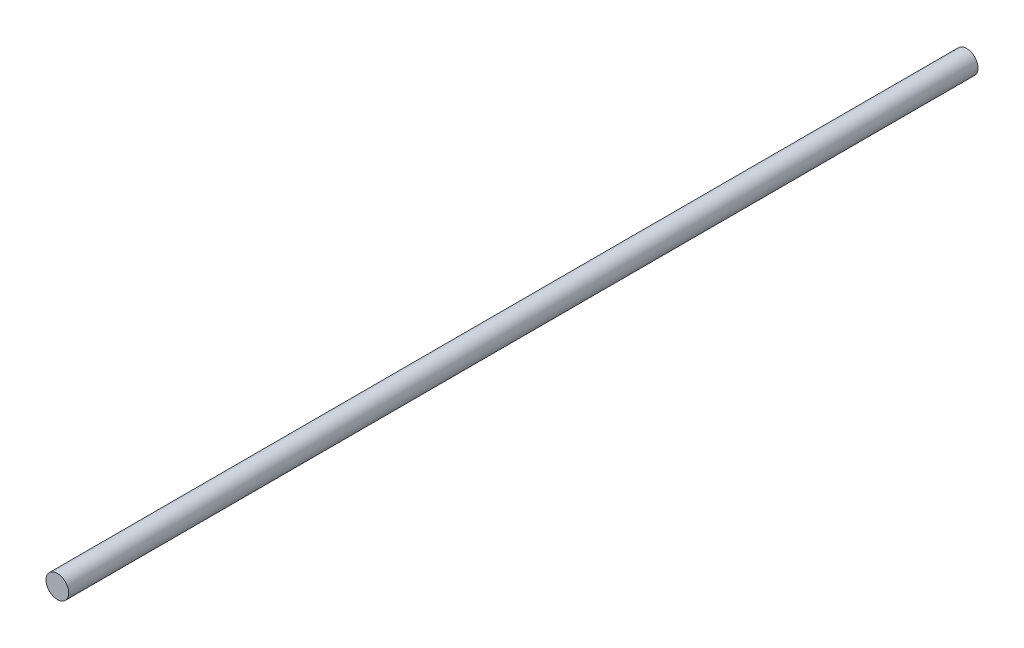
ISO-10303-21;
HEADER;
FILE_DESCRIPTION(('STEP AP214'),'2;1');
FILE_NAME('part.step','',(''),(''),'','','');
FILE_SCHEMA(('AUTOMOTIVE_DESIGN { 1 0 10303 214 1 1 1 1 }'));
ENDSEC;
DATA;
#1=APPLICATION_CONTEXT('core data for automotive mechanical design processes');
#2=APPLICATION_PROTOCOL_DEFINITION('international standard','automotive_design',2000,#1);
#3=PRODUCT_CONTEXT('',#1,'mechanical');
#4=PRODUCT('Part','Part','',(#3));
#5=PRODUCT_RELATED_PRODUCT_CATEGORY('part','',(#4));
#6=PRODUCT_DEFINITION_FORMATION('','',#4);
#7=PRODUCT_DEFINITION_CONTEXT('part definition',#1,'design');
#8=PRODUCT_DEFINITION('design','',#6,#7);
#9=PRODUCT_DEFINITION_SHAPE('','',#8);
#10=(LENGTH_UNIT() NAMED_UNIT(*) SI_UNIT(.MILLI.,.METRE.));
#11=(NAMED_UNIT(*) PLANE_ANGLE_UNIT() SI_UNIT($,.RADIAN.));
#12=(NAMED_UNIT(*) SI_UNIT($,.STERADIAN.) SOLID_ANGLE_UNIT());
#13=UNCERTAINTY_MEASURE_WITH_UNIT(LENGTH_MEASURE(1.E-05),#10,'distance_accuracy_value','');
#14=(GEOMETRIC_REPRESENTATION_CONTEXT(3) GLOBAL_UNCERTAINTY_ASSIGNED_CONTEXT((#13)) GLOBAL_UNIT_ASSIGNED_CONTEXT((#10,
#11,#12)) REPRESENTATION_CONTEXT('',''));
#15=CARTESIAN_POINT('',(0.,0.,0.));
#16=DIRECTION('',(0.,0.,1.));
#17=DIRECTION('',(1.,0.,0.));
#18=AXIS2_PLACEMENT_3D('',#15,#16,#17);
#19=CARTESIAN_POINT('',(0.,0.,100.));
#20=DIRECTION('',(0.,0.,-1.));
#21=DIRECTION('',(-1.,0.,0.));
#22=AXIS2_PLACEMENT_3D('',#19,#20,#21);
#23=CYLINDRICAL_SURFACE('',#22,2.5);
#24=CARTESIAN_POINT('',(0.,0.,100.));
#25=DIRECTION('',(0.,0.,1.));
#26=DIRECTION('',(1.,0.,0.));
#27=AXIS2_PLACEMENT_3D('',#24,#25,#26);
#28=CIRCLE('',#27,2.5);
#29=CARTESIAN_POINT('',(2.5,0.,100.));
#30=VERTEX_POINT('',#29);
#31=EDGE_CURVE('E10',#30,#30,#28,.T.);
#32=ORIENTED_EDGE('',*,*,#31,.F.);
#33=EDGE_LOOP('',(#32));
#34=FACE_BOUND('',#33,.T.);
#35=CARTESIAN_POINT('',(0.,0.,-100.));
#36=DIRECTION('',(0.,0.,1.));
#37=DIRECTION('',(1.,0.,0.));
#38=AXIS2_PLACEMENT_3D('',#35,#36,#37);
#39=CIRCLE('',#38,2.5);
#40=CARTESIAN_POINT('',(2.5,0.,-100.));
#41=VERTEX_POINT('',#40);
#42=EDGE_CURVE('E38',#41,#41,#39,.T.);
#43=ORIENTED_EDGE('',*,*,#42,.T.);
#44=EDGE_LOOP('',(#43));
#45=FACE_BOUND('',#44,.T.);
#46=ADVANCED_FACE('F35',(#34,#45),#23,.T.);
#47=CARTESIAN_POINT('',(0.,0.,100.));
#48=DIRECTION('',(0.,0.,1.));
#49=DIRECTION('',(1.,0.,0.));
#50=AXIS2_PLACEMENT_3D('',#47,#48,#49);
#51=PLANE('',#50);
#52=ORIENTED_EDGE('',*,*,#31,.T.);
#53=EDGE_LOOP('',(#52));
#54=FACE_BOUND('',#53,.T.);
#55=ADVANCED_FACE('F52',(#54),#51,.T.);
#56=CARTESIAN_POINT('',(0.,0.,-100.));
#57=DIRECTION('',(0.,0.,1.));
#58=DIRECTION('',(1.,0.,0.));
#59=AXIS2_PLACEMENT_3D('',#56,#57,#58);
#60=PLANE('',#59);
#61=ORIENTED_EDGE('',*,*,#42,.F.);
#62=EDGE_LOOP('',(#61));
#63=FACE_BOUND('',#62,.T.);
#64=ADVANCED_FACE('F50',(#63),#60,.F.);
#65=CLOSED_SHELL('',(#46,#55,#64));
#66=MANIFOLD_SOLID_BREP('B2',#65);
#67=ADVANCED_BREP_SHAPE_REPRESENTATION('',(#18,#66),#14);
#68=SHAPE_DEFINITION_REPRESENTATION(#9,#67);
ENDSEC;
END-ISO-10303-21;
